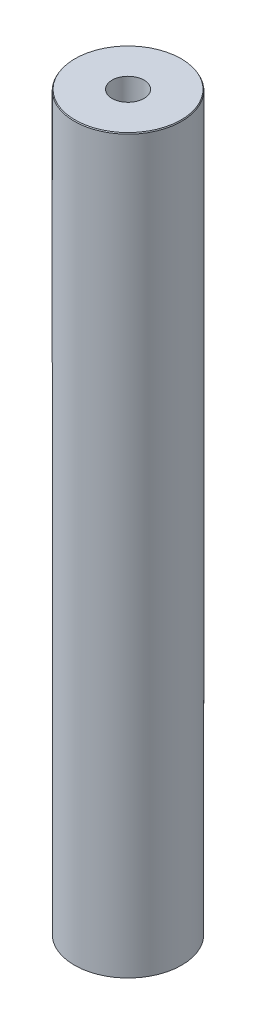
ISO-10303-21;
HEADER;
FILE_DESCRIPTION(('STEP AP214'),'2;1');
FILE_NAME('part.step','',(''),(''),'','','');
FILE_SCHEMA(('AUTOMOTIVE_DESIGN { 1 0 10303 214 1 1 1 1 }'));
ENDSEC;
DATA;
#1=APPLICATION_CONTEXT('core data for automotive mechanical design processes');
#2=APPLICATION_PROTOCOL_DEFINITION('international standard','automotive_design',2000,#1);
#3=PRODUCT_CONTEXT('',#1,'mechanical');
#4=PRODUCT('Part','Part','',(#3));
#5=PRODUCT_RELATED_PRODUCT_CATEGORY('part','',(#4));
#6=PRODUCT_DEFINITION_FORMATION('','',#4);
#7=PRODUCT_DEFINITION_CONTEXT('part definition',#1,'design');
#8=PRODUCT_DEFINITION('design','',#6,#7);
#9=PRODUCT_DEFINITION_SHAPE('','',#8);
#10=(LENGTH_UNIT() NAMED_UNIT(*) SI_UNIT(.MILLI.,.METRE.));
#11=(NAMED_UNIT(*) PLANE_ANGLE_UNIT() SI_UNIT($,.RADIAN.));
#12=(NAMED_UNIT(*) SI_UNIT($,.STERADIAN.) SOLID_ANGLE_UNIT());
#13=UNCERTAINTY_MEASURE_WITH_UNIT(LENGTH_MEASURE(1.E-05),#10,'distance_accuracy_value','');
#14=(GEOMETRIC_REPRESENTATION_CONTEXT(3) GLOBAL_UNCERTAINTY_ASSIGNED_CONTEXT((#13)) GLOBAL_UNIT_ASSIGNED_CONTEXT((#10,
#11,#12)) REPRESENTATION_CONTEXT('',''));
#15=CARTESIAN_POINT('',(0.,0.,0.));
#16=DIRECTION('',(0.,0.,1.));
#17=DIRECTION('',(1.,0.,0.));
#18=AXIS2_PLACEMENT_3D('',#15,#16,#17);
#19=CARTESIAN_POINT('',(0.,478.020058114817,0.));
#20=DIRECTION('',(0.,-1.,0.));
#21=DIRECTION('',(0.,0.,-1.));
#22=AXIS2_PLACEMENT_3D('',#19,#20,#21);
#23=CYLINDRICAL_SURFACE('',#22,35.);
#24=CARTESIAN_POINT('',(0.,477.370415452361,0.));
#25=DIRECTION('',(0.,1.,0.));
#26=DIRECTION('',(0.,0.,1.));
#27=AXIS2_PLACEMENT_3D('',#24,#25,#26);
#28=CIRCLE('',#27,35.);
#29=CARTESIAN_POINT('',(0.,477.370415452361,-35.));
#30=VERTEX_POINT('',#29);
#31=EDGE_CURVE('E50',#30,#30,#28,.F.);
#32=ORIENTED_EDGE('',*,*,#31,.T.);
#33=EDGE_LOOP('',(#32));
#34=FACE_BOUND('',#33,.T.);
#35=CARTESIAN_POINT('',(0.,0.375071366046031,0.));
#36=DIRECTION('',(0.,1.,0.));
#37=DIRECTION('',(0.,0.,1.));
#38=AXIS2_PLACEMENT_3D('',#35,#36,#37);
#39=CIRCLE('',#38,35.);
#40=CARTESIAN_POINT('',(0.,0.375071366046031,35.));
#41=VERTEX_POINT('',#40);
#42=EDGE_CURVE('E51',#41,#41,#39,.T.);
#43=ORIENTED_EDGE('',*,*,#42,.T.);
#44=EDGE_LOOP('',(#43));
#45=FACE_BOUND('',#44,.T.);
#46=ADVANCED_FACE('F39',(#34,#45),#23,.T.);
#47=CARTESIAN_POINT('',(0.,478.020058114817,0.));
#48=DIRECTION('',(0.,1.,0.));
#49=DIRECTION('',(0.,0.,1.));
#50=AXIS2_PLACEMENT_3D('',#47,#48,#49);
#51=PLANE('',#50);
#52=CARTESIAN_POINT('',(0.,478.020058114817,0.));
#53=DIRECTION('',(0.,1.,0.));
#54=DIRECTION('',(0.,0.,1.));
#55=AXIS2_PLACEMENT_3D('',#52,#53,#54);
#56=CIRCLE('',#55,34.6249286339538);
#57=CARTESIAN_POINT('',(0.,478.020058114817,-34.6249286339539));
#58=VERTEX_POINT('',#57);
#59=EDGE_CURVE('E54',#58,#58,#56,.T.);
#60=ORIENTED_EDGE('',*,*,#59,.T.);
#61=EDGE_LOOP('',(#60));
#62=FACE_BOUND('',#61,.T.);
#63=CARTESIAN_POINT('',(0.,478.020058114817,0.));
#64=DIRECTION('',(0.,1.,0.));
#65=DIRECTION('',(0.,0.,1.));
#66=AXIS2_PLACEMENT_3D('',#63,#64,#65);
#67=CIRCLE('',#66,10.413015290257);
#68=CARTESIAN_POINT('',(0.,478.020058114817,10.413015290257));
#69=VERTEX_POINT('',#68);
#70=EDGE_CURVE('E58',#69,#69,#67,.T.);
#71=ORIENTED_EDGE('',*,*,#70,.F.);
#72=EDGE_LOOP('',(#71));
#73=FACE_BOUND('',#72,.T.);
#74=ADVANCED_FACE('F69',(#62,#73),#51,.T.);
#75=CARTESIAN_POINT('',(0.,0.,0.));
#76=DIRECTION('',(0.,1.,0.));
#77=DIRECTION('',(0.,0.,1.));
#78=AXIS2_PLACEMENT_3D('',#75,#76,#77);
#79=PLANE('',#78);
#80=CARTESIAN_POINT('',(0.,0.,0.));
#81=DIRECTION('',(0.,1.,0.));
#82=DIRECTION('',(0.,0.,1.));
#83=AXIS2_PLACEMENT_3D('',#80,#81,#82);
#84=CIRCLE('',#83,34.350357337544);
#85=CARTESIAN_POINT('',(0.,0.,34.350357337544));
#86=VERTEX_POINT('',#85);
#87=EDGE_CURVE('E10',#86,#86,#84,.F.);
#88=ORIENTED_EDGE('',*,*,#87,.T.);
#89=EDGE_LOOP('',(#88));
#90=FACE_BOUND('',#89,.T.);
#91=CARTESIAN_POINT('',(0.,0.,0.));
#92=DIRECTION('',(0.,1.,0.));
#93=DIRECTION('',(0.,0.,1.));
#94=AXIS2_PLACEMENT_3D('',#91,#92,#93);
#95=CIRCLE('',#94,10.413015290257);
#96=CARTESIAN_POINT('',(0.,0.,10.413015290257));
#97=VERTEX_POINT('',#96);
#98=EDGE_CURVE('E63',#97,#97,#95,.T.);
#99=ORIENTED_EDGE('',*,*,#98,.T.);
#100=EDGE_LOOP('',(#99));
#101=FACE_BOUND('',#100,.T.);
#102=ADVANCED_FACE('F75',(#90,#101),#79,.F.);
#103=CARTESIAN_POINT('',(0.,478.020058114817,0.));
#104=DIRECTION('',(0.,-1.,0.));
#105=DIRECTION('',(0.,0.,-1.));
#106=AXIS2_PLACEMENT_3D('',#103,#104,#105);
#107=CYLINDRICAL_SURFACE('',#106,10.413015290257);
#108=ORIENTED_EDGE('',*,*,#70,.T.);
#109=EDGE_LOOP('',(#108));
#110=FACE_BOUND('',#109,.T.);
#111=ORIENTED_EDGE('',*,*,#98,.F.);
#112=EDGE_LOOP('',(#111));
#113=FACE_BOUND('',#112,.T.);
#114=ADVANCED_FACE('F70',(#110,#113),#107,.F.);
#115=CARTESIAN_POINT('',(0.,478.020058114817,0.));
#116=DIRECTION('',(0.,-1.,0.));
#117=DIRECTION('',(0.,0.,-1.));
#118=AXIS2_PLACEMENT_3D('',#115,#116,#117);
#119=CONICAL_SURFACE('',#118,34.6249286339538,0.52359877559836);
#120=CARTESIAN_POINT('',(0.,477.370415452361,-35.));
#121=CARTESIAN_POINT('',(0.,477.377182563428,-34.9960930066037));
#122=CARTESIAN_POINT('',(0.,477.383949674495,-34.9921860132074));
#123=CARTESIAN_POINT('',(0.,477.39748389663,-34.9843720264148));
#124=CARTESIAN_POINT('',(0.,477.404251007697,-34.9804650330185));
#125=CARTESIAN_POINT('',(0.,477.417785229832,-34.9726510462258));
#126=CARTESIAN_POINT('',(0.,477.424552340899,-34.9687440528295));
#127=CARTESIAN_POINT('',(0.,477.438086563033,-34.9609300660369));
#128=CARTESIAN_POINT('',(0.,477.444853674101,-34.9570230726406));
#129=CARTESIAN_POINT('',(0.,477.458387896235,-34.9492090858479));
#130=CARTESIAN_POINT('',(0.,477.465155007302,-34.9453020924516));
#131=CARTESIAN_POINT('',(0.,477.478689229437,-34.937488105659));
#132=CARTESIAN_POINT('',(0.,477.485456340504,-34.9335811122627));
#133=CARTESIAN_POINT('',(0.,477.498990562639,-34.9257671254701));
#134=CARTESIAN_POINT('',(0.,477.505757673706,-34.9218601320737));
#135=CARTESIAN_POINT('',(0.,477.51929189584,-34.9140461452811));
#136=CARTESIAN_POINT('',(0.,477.526059006908,-34.9101391518848));
#137=CARTESIAN_POINT('',(0.,477.539593229042,-34.9023251650922));
#138=CARTESIAN_POINT('',(0.,477.546360340109,-34.8984181716959));
#139=CARTESIAN_POINT('',(0.,477.559894562244,-34.8906041849032));
#140=CARTESIAN_POINT('',(0.,477.566661673311,-34.8866971915069));
#141=CARTESIAN_POINT('',(0.,477.580195895446,-34.8788832047143));
#142=CARTESIAN_POINT('',(0.,477.586963006513,-34.874976211318));
#143=CARTESIAN_POINT('',(0.,477.600497228647,-34.8671622245253));
#144=CARTESIAN_POINT('',(0.,477.607264339715,-34.863255231129));
#145=CARTESIAN_POINT('',(0.,477.620798561849,-34.8554412443364));
#146=CARTESIAN_POINT('',(0.,477.627565672916,-34.8515342509401));
#147=CARTESIAN_POINT('',(0.,477.641099895051,-34.8437202641475));
#148=CARTESIAN_POINT('',(0.,477.647867006118,-34.8398132707511));
#149=CARTESIAN_POINT('',(0.,477.661401228253,-34.8319992839585));
#150=CARTESIAN_POINT('',(0.,477.66816833932,-34.8280922905622));
#151=CARTESIAN_POINT('',(0.,477.681702561454,-34.8202783037696));
#152=CARTESIAN_POINT('',(0.,477.688469672522,-34.8163713103733));
#153=CARTESIAN_POINT('',(0.,477.702003894656,-34.8085573235806));
#154=CARTESIAN_POINT('',(0.,477.708771005723,-34.8046503301843));
#155=CARTESIAN_POINT('',(0.,477.722305227858,-34.7968363433917));
#156=CARTESIAN_POINT('',(0.,477.729072338925,-34.7929293499954));
#157=CARTESIAN_POINT('',(0.,477.74260656106,-34.7851153632027));
#158=CARTESIAN_POINT('',(0.,477.749373672127,-34.7812083698064));
#159=CARTESIAN_POINT('',(0.,477.762907894261,-34.7733943830138));
#160=CARTESIAN_POINT('',(0.,477.769675005329,-34.7694873896175));
#161=CARTESIAN_POINT('',(0.,477.783209227463,-34.7616734028248));
#162=CARTESIAN_POINT('',(0.,477.78997633853,-34.7577664094285));
#163=CARTESIAN_POINT('',(0.,477.803510560665,-34.7499524226359));
#164=CARTESIAN_POINT('',(0.,477.810277671732,-34.7460454292396));
#165=CARTESIAN_POINT('',(0.,477.823811893867,-34.738231442447));
#166=CARTESIAN_POINT('',(0.,477.830579004934,-34.7343244490506));
#167=CARTESIAN_POINT('',(0.,477.844113227068,-34.726510462258));
#168=CARTESIAN_POINT('',(0.,477.850880338136,-34.7226034688617));
#169=CARTESIAN_POINT('',(0.,477.86441456027,-34.7147894820691));
#170=CARTESIAN_POINT('',(0.,477.871181671337,-34.7108824886728));
#171=CARTESIAN_POINT('',(0.,477.884715893472,-34.7030685018801));
#172=CARTESIAN_POINT('',(0.,477.891483004539,-34.6991615084838));
#173=CARTESIAN_POINT('',(0.,477.905017226674,-34.6913475216912));
#174=CARTESIAN_POINT('',(0.,477.911784337741,-34.6874405282949));
#175=CARTESIAN_POINT('',(0.,477.925318559875,-34.6796265415023));
#176=CARTESIAN_POINT('',(0.,477.932085670943,-34.6757195481059));
#177=CARTESIAN_POINT('',(0.,477.945619893077,-34.6679055613133));
#178=CARTESIAN_POINT('',(0.,477.952387004144,-34.663998567917));
#179=CARTESIAN_POINT('',(0.,477.965921226279,-34.6561845811244));
#180=CARTESIAN_POINT('',(0.,477.972688337346,-34.6522775877281));
#181=CARTESIAN_POINT('',(0.,477.986222559481,-34.6444636009354));
#182=CARTESIAN_POINT('',(0.,477.992989670548,-34.6405566075391));
#183=CARTESIAN_POINT('',(0.,478.006523892682,-34.6327426207465));
#184=CARTESIAN_POINT('',(0.,478.01329100375,-34.6288356273502));
#185=CARTESIAN_POINT('',(0.,478.020058114817,-34.6249286339539));
#186=B_SPLINE_CURVE_WITH_KNOTS('',3,(#120,#121,#122,#123,#124,#125,#126,#127,#128,#129,#130,
#131,#132,#133,#134,#135,#136,#137,#138,#139,#140,#141,#142,#143,#144,#145,#146,#147,#148,#149,
#150,#151,#152,#153,#154,#155,#156,#157,#158,#159,#160,#161,#162,#163,#164,#165,#166,#167,#168,
#169,#170,#171,#172,#173,#174,#175,#176,#177,#178,#179,#180,#181,#182,#183,#184,#185),
.UNSPECIFIED.,.F.,.F.,(4,2,2,2,2,2,2,2,2,2,2,2,2,2,2,2,2,2,2,2,2,2,2,2,2,2,2,2,2,2,2,2,4),(0.,
0.0234419603778749,0.0468839207557463,0.0703258811336212,0.0937678415114961,0.117209801889371,
0.140651762267294,0.164093722645169,0.187535683023044,0.210977643400919,0.234419603778794,
0.257861564156717,0.281303524534592,0.304745484912463,0.328187445290338,0.351629405668213,
0.375071366046136,0.398513326424011,0.421955286801886,0.44539724717976,0.468839207557635,
0.49228116793551,0.515723128313433,0.539165088691308,0.562607049069179,0.586049009447054,
0.609490969824929,0.632932930202852,0.656374890580727,0.679816850958602,0.703258811336477,
0.726700771714352,0.750142732092275),.UNSPECIFIED.);
#187=EDGE_CURVE('BSEAM81',#30,#58,#186,.T.);
#188=ORIENTED_EDGE('',*,*,#31,.F.);
#189=ORIENTED_EDGE('',*,*,#59,.F.);
#190=ORIENTED_EDGE('',*,*,#187,.T.);
#191=ORIENTED_EDGE('',*,*,#187,.F.);
#192=EDGE_LOOP('',(#188,#190,#189,#191));
#193=FACE_BOUND('',#192,.T.);
#194=ADVANCED_FACE('F81',(#193),#119,.T.);
#195=CARTESIAN_POINT('',(0.,0.375071366046031,0.));
#196=DIRECTION('',(0.,1.,0.));
#197=DIRECTION('',(0.,0.,1.));
#198=AXIS2_PLACEMENT_3D('',#195,#196,#197);
#199=CONICAL_SURFACE('',#198,35.,1.04719755119658);
#200=ORIENTED_EDGE('',*,*,#87,.F.);
#201=EDGE_LOOP('',(#200));
#202=FACE_BOUND('',#201,.T.);
#203=ORIENTED_EDGE('',*,*,#42,.F.);
#204=EDGE_LOOP('',(#203));
#205=FACE_BOUND('',#204,.T.);
#206=ADVANCED_FACE('F45',(#202,#205),#199,.T.);
#207=CLOSED_SHELL('',(#46,#74,#102,#114,#194,#206));
#208=MANIFOLD_SOLID_BREP('B2',#207);
#209=ADVANCED_BREP_SHAPE_REPRESENTATION('',(#18,#208),#14);
#210=SHAPE_DEFINITION_REPRESENTATION(#9,#209);
ENDSEC;
END-ISO-10303-21;
